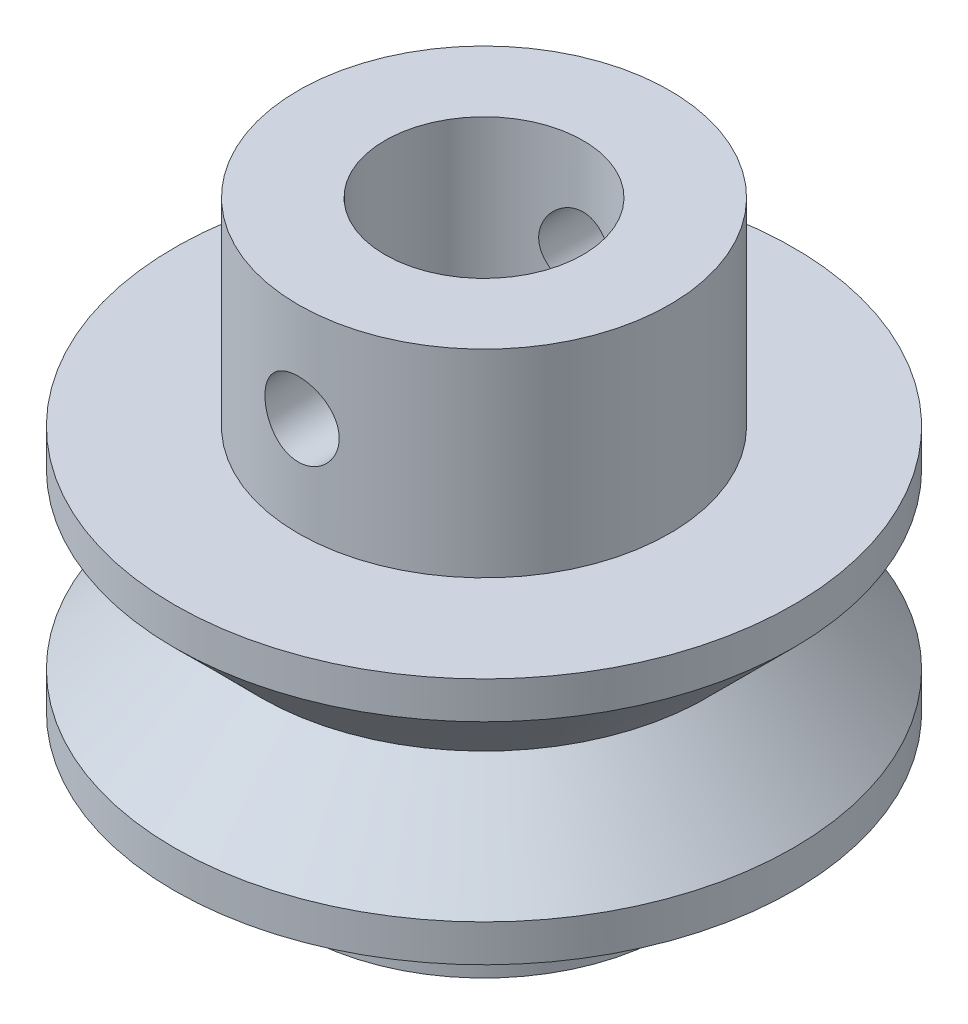
ISO-10303-21;
HEADER;
FILE_DESCRIPTION(('STEP AP214'),'2;1');
FILE_NAME('part.step','',(''),(''),'','','');
FILE_SCHEMA(('AUTOMOTIVE_DESIGN { 1 0 10303 214 1 1 1 1 }'));
ENDSEC;
DATA;
#1=APPLICATION_CONTEXT('core data for automotive mechanical design processes');
#2=APPLICATION_PROTOCOL_DEFINITION('international standard','automotive_design',2000,#1);
#3=PRODUCT_CONTEXT('',#1,'mechanical');
#4=PRODUCT('Part','Part','',(#3));
#5=PRODUCT_RELATED_PRODUCT_CATEGORY('part','',(#4));
#6=PRODUCT_DEFINITION_FORMATION('','',#4);
#7=PRODUCT_DEFINITION_CONTEXT('part definition',#1,'design');
#8=PRODUCT_DEFINITION('design','',#6,#7);
#9=PRODUCT_DEFINITION_SHAPE('','',#8);
#10=(LENGTH_UNIT() NAMED_UNIT(*) SI_UNIT(.MILLI.,.METRE.));
#11=(NAMED_UNIT(*) PLANE_ANGLE_UNIT() SI_UNIT($,.RADIAN.));
#12=(NAMED_UNIT(*) SI_UNIT($,.STERADIAN.) SOLID_ANGLE_UNIT());
#13=UNCERTAINTY_MEASURE_WITH_UNIT(LENGTH_MEASURE(1.E-05),#10,'distance_accuracy_value','');
#14=(GEOMETRIC_REPRESENTATION_CONTEXT(3) GLOBAL_UNCERTAINTY_ASSIGNED_CONTEXT((#13)) GLOBAL_UNIT_ASSIGNED_CONTEXT((#10,
#11,#12)) REPRESENTATION_CONTEXT('',''));
#15=CARTESIAN_POINT('',(0.,0.,0.));
#16=DIRECTION('',(0.,0.,1.));
#17=DIRECTION('',(1.,0.,0.));
#18=AXIS2_PLACEMENT_3D('',#15,#16,#17);
#19=CARTESIAN_POINT('',(0.,-5.,0.));
#20=DIRECTION('',(0.,1.,0.));
#21=DIRECTION('',(0.,0.,1.));
#22=AXIS2_PLACEMENT_3D('',#19,#20,#21);
#23=CYLINDRICAL_SURFACE('',#22,12.5);
#24=CARTESIAN_POINT('',(0.,3.5,0.));
#25=DIRECTION('',(0.,-1.,0.));
#26=DIRECTION('',(0.,0.,-1.));
#27=AXIS2_PLACEMENT_3D('',#24,#25,#26);
#28=CIRCLE('',#27,12.5);
#29=CARTESIAN_POINT('',(0.,3.5,-12.5));
#30=VERTEX_POINT('',#29);
#31=EDGE_CURVE('E102',#30,#30,#28,.T.);
#32=ORIENTED_EDGE('',*,*,#31,.F.);
#33=EDGE_LOOP('',(#32));
#34=FACE_BOUND('',#33,.T.);
#35=CARTESIAN_POINT('',(0.,5.,0.));
#36=DIRECTION('',(0.,1.,0.));
#37=DIRECTION('',(0.,0.,1.));
#38=AXIS2_PLACEMENT_3D('',#35,#36,#37);
#39=CIRCLE('',#38,12.5);
#40=CARTESIAN_POINT('',(0.,5.,12.5));
#41=VERTEX_POINT('',#40);
#42=EDGE_CURVE('E108',#41,#41,#39,.T.);
#43=ORIENTED_EDGE('',*,*,#42,.F.);
#44=EDGE_LOOP('',(#43));
#45=FACE_BOUND('',#44,.T.);
#46=ADVANCED_FACE('F43',(#34,#45),#23,.T.);
#47=CARTESIAN_POINT('',(0.,13.,0.));
#48=DIRECTION('',(0.,-1.,0.));
#49=DIRECTION('',(0.,0.,-1.));
#50=AXIS2_PLACEMENT_3D('',#47,#48,#49);
#51=CYLINDRICAL_SURFACE('',#50,7.5);
#52=CARTESIAN_POINT('',(0.,-9.,0.));
#53=DIRECTION('',(0.,1.,0.));
#54=DIRECTION('',(0.,0.,1.));
#55=AXIS2_PLACEMENT_3D('',#52,#53,#54);
#56=CIRCLE('',#55,7.5);
#57=CARTESIAN_POINT('',(0.,-9.,7.5));
#58=VERTEX_POINT('',#57);
#59=EDGE_CURVE('E117',#58,#58,#56,.T.);
#60=ORIENTED_EDGE('',*,*,#59,.T.);
#61=EDGE_LOOP('',(#60));
#62=FACE_BOUND('',#61,.T.);
#63=CARTESIAN_POINT('',(0.,-5.,0.));
#64=DIRECTION('',(0.,1.,0.));
#65=DIRECTION('',(0.,0.,1.));
#66=AXIS2_PLACEMENT_3D('',#63,#64,#65);
#67=CIRCLE('',#66,7.5);
#68=CARTESIAN_POINT('',(0.,-5.,7.5));
#69=VERTEX_POINT('',#68);
#70=EDGE_CURVE('E10',#69,#69,#67,.T.);
#71=ORIENTED_EDGE('',*,*,#70,.F.);
#72=EDGE_LOOP('',(#71));
#73=FACE_BOUND('',#72,.T.);
#74=ADVANCED_FACE('F132',(#62,#73),#51,.T.);
#75=CARTESIAN_POINT('',(0.,13.,0.));
#76=DIRECTION('',(0.,-1.,0.));
#77=DIRECTION('',(0.,0.,-1.));
#78=AXIS2_PLACEMENT_3D('',#75,#76,#77);
#79=CYLINDRICAL_SURFACE('',#78,4.);
#80=CARTESIAN_POINT('',(0.,10.5,-4.));
#81=CARTESIAN_POINT('',(-0.0812350589378528,10.5000029023031,-4.00000217456151));
#82=CARTESIAN_POINT('',(-0.162450241781792,10.4933802397516,-3.99750379283184));
#83=CARTESIAN_POINT('',(-0.322453452352361,10.4671718047301,-3.98778696006928));
#84=CARTESIAN_POINT('',(-0.401241827987615,10.4475878995294,-3.98056918893993));
#85=CARTESIAN_POINT('',(-0.554060784990879,10.3962469982282,-3.96218832391545));
#86=CARTESIAN_POINT('',(-0.628100224162279,10.3645134831782,-3.9510328434944));
#87=CARTESIAN_POINT('',(-0.769799310160254,10.2898935869842,-3.92588767765353));
#88=CARTESIAN_POINT('',(-0.837457239177879,10.2470042144558,-3.91189723227548));
#89=CARTESIAN_POINT('',(-0.967346417045825,10.1493874689291,-3.88186246971217));
#90=CARTESIAN_POINT('',(-1.02927073015119,10.0942697377406,-3.86576002583566));
#91=CARTESIAN_POINT('',(-1.14324421474363,9.97458956534116,-3.83360220871327));
#92=CARTESIAN_POINT('',(-1.19529036359203,9.91002424391213,-3.81754685135033));
#93=CARTESIAN_POINT('',(-1.28998202215985,9.77028253247679,-3.78662470617731));
#94=CARTESIAN_POINT('',(-1.3321939319576,9.69479563345418,-3.77182648820818));
#95=CARTESIAN_POINT('',(-1.40318646334084,9.53715164583148,-3.74599860237433));
#96=CARTESIAN_POINT('',(-1.43197244961239,9.4549972368449,-3.73496742975881));
#97=CARTESIAN_POINT('',(-1.47408431017549,9.2898832597418,-3.71854412824136));
#98=CARTESIAN_POINT('',(-1.48799593218558,9.20709496156456,-3.71293924350838));
#99=CARTESIAN_POINT('',(-1.50179556531648,9.04018384200616,-3.70738061461215));
#100=CARTESIAN_POINT('',(-1.5016893680263,8.95606158612553,-3.70742453659305));
#101=CARTESIAN_POINT('',(-1.48790429610018,8.79423047478704,-3.71297511632055));
#102=CARTESIAN_POINT('',(-1.47503808509003,8.71643909395583,-3.71815468871122));
#103=CARTESIAN_POINT('',(-1.4374416786833,8.56421284959468,-3.73284938059529));
#104=CARTESIAN_POINT('',(-1.41270969663258,8.48977849338612,-3.74236515298863));
#105=CARTESIAN_POINT('',(-1.35163748571904,8.34472293227177,-3.76485702190253));
#106=CARTESIAN_POINT('',(-1.31508648737101,8.2742005138787,-3.77789517988166));
#107=CARTESIAN_POINT('',(-1.23156073762698,8.14005426240903,-3.80594210139319));
#108=CARTESIAN_POINT('',(-1.18458238728897,8.0764328224803,-3.82095154457158));
#109=CARTESIAN_POINT('',(-1.07781780766549,7.95339633634913,-3.85248038859113));
#110=CARTESIAN_POINT('',(-1.01738298716956,7.89455135925191,-3.86903347455671));
#111=CARTESIAN_POINT('',(-0.887312590819021,7.7876620337942,-3.90091728164085));
#112=CARTESIAN_POINT('',(-0.817675603497364,7.73961934539433,-3.91624781465952));
#113=CARTESIAN_POINT('',(-0.66972343699242,7.65506960293748,-3.9442639480908));
#114=CARTESIAN_POINT('',(-0.59129071384472,7.61875241877894,-3.95690498259616));
#115=CARTESIAN_POINT('',(-0.428836850524584,7.56001739572996,-3.97778718326962));
#116=CARTESIAN_POINT('',(-0.344818210845768,7.53759338343888,-3.98603030341493));
#117=CARTESIAN_POINT('',(-0.178375243148666,7.50837721245806,-3.99684443228065));
#118=CARTESIAN_POINT('',(-0.0961036195622104,7.50081739361749,-3.99969369025686));
#119=CARTESIAN_POINT('',(0.0685724752550233,7.49930893610008,-4.00025893700126));
#120=CARTESIAN_POINT('',(0.150976912983372,7.50535727968322,-3.99797606386863));
#121=CARTESIAN_POINT('',(0.310262048561858,7.53031004230867,-3.98871709772643));
#122=CARTESIAN_POINT('',(0.387233328007335,7.54871154373709,-3.98192470962305));
#123=CARTESIAN_POINT('',(0.53694175495722,7.59718607254732,-3.96451477091717));
#124=CARTESIAN_POINT('',(0.609678350347534,7.62726061794804,-3.9538967228203));
#125=CARTESIAN_POINT('',(0.751247765110155,7.69918641243948,-3.92949624407681));
#126=CARTESIAN_POINT('',(0.819903083557794,7.74135772922339,-3.91563000209348));
#127=CARTESIAN_POINT('',(0.949392711726624,7.83591810317156,-3.88626671564664));
#128=CARTESIAN_POINT('',(1.01022412027045,7.88831093254515,-3.87076907009516));
#129=CARTESIAN_POINT('',(1.12603079874454,8.00540412212428,-3.8387332949099));
#130=CARTESIAN_POINT('',(1.18046154123568,8.0706421827727,-3.82218696503729));
#131=CARTESIAN_POINT('',(1.27771050031903,8.20965138470766,-3.79078815746854));
#132=CARTESIAN_POINT('',(1.32052767414518,8.2834232913885,-3.77593583194399));
#133=CARTESIAN_POINT('',(1.39337773518998,8.43801598677231,-3.74966829822463));
#134=CARTESIAN_POINT('',(1.42335685446918,8.51886474591043,-3.73826760328493));
#135=CARTESIAN_POINT('',(1.46907883466889,8.68500976368782,-3.72054032891005));
#136=CARTESIAN_POINT('',(1.48483050305535,8.77030323619812,-3.71421061057491));
#137=CARTESIAN_POINT('',(1.50086347097839,8.93701615954112,-3.70775894792573));
#138=CARTESIAN_POINT('',(1.50207331495837,9.01833263171689,-3.70726444523341));
#139=CARTESIAN_POINT('',(1.49136715641593,9.17994531627617,-3.71158412745292));
#140=CARTESIAN_POINT('',(1.47945239850124,9.26024162467158,-3.71639780898899));
#141=CARTESIAN_POINT('',(1.44355815630242,9.41504722671655,-3.73048141585432));
#142=CARTESIAN_POINT('',(1.41995798316524,9.48965834624535,-3.73961085376663));
#143=CARTESIAN_POINT('',(1.3616969677992,9.63390550849442,-3.76121548297845));
#144=CARTESIAN_POINT('',(1.32703332944945,9.70354028807014,-3.77369151995215));
#145=CARTESIAN_POINT('',(1.24552075938154,9.83982678969763,-3.80139723903964));
#146=CARTESIAN_POINT('',(1.1981283280301,9.90613079679991,-3.81673698440964));
#147=CARTESIAN_POINT('',(1.09334485729906,10.0301415609712,-3.84806246757177));
#148=CARTESIAN_POINT('',(1.03595064012808,10.0878455747868,-3.86404840943145));
#149=CARTESIAN_POINT('',(0.909080396784624,10.1962019558218,-3.89590424609881));
#150=CARTESIAN_POINT('',(0.839118644212993,10.2463037534347,-3.91172104900645));
#151=CARTESIAN_POINT('',(0.691213223200822,10.3340226552766,-3.94054514457031));
#152=CARTESIAN_POINT('',(0.613268934090622,10.3716387877364,-3.95355221851559));
#153=CARTESIAN_POINT('',(0.447999082002313,10.4343768290483,-3.9757429260668));
#154=CARTESIAN_POINT('',(0.360413422234209,10.4588870646019,-3.98473657158356));
#155=CARTESIAN_POINT('',(0.181875733606382,10.4916929599207,-3.99686242179587));
#156=CARTESIAN_POINT('',(0.090925416364859,10.4999967514873,-3.99999756603967));
#157=CARTESIAN_POINT('',(0.,10.5,-4.));
#158=B_SPLINE_CURVE_WITH_KNOTS('',3,(#80,#81,#82,#83,#84,#85,#86,#87,#88,#89,#90,#91,#92,#93,
#94,#95,#96,#97,#98,#99,#100,#101,#102,#103,#104,#105,#106,#107,#108,#109,#110,#111,#112,#113,
#114,#115,#116,#117,#118,#119,#120,#121,#122,#123,#124,#125,#126,#127,#128,#129,#130,#131,#132,
#133,#134,#135,#136,#137,#138,#139,#140,#141,#142,#143,#144,#145,#146,#147,#148,#149,#150,#151,
#152,#153,#154,#155,#156,#157),.UNSPECIFIED.,.T.,.F.,(4,2,2,2,2,2,2,2,2,2,2,2,2,2,2,2,2,2,2,2,2,
2,2,2,2,2,2,2,2,2,2,2,2,2,2,2,2,2,4),(0.,0.243369801560559,0.48670454953046,0.729571369213574,
0.972503379609489,1.22473618582715,1.47704604925622,1.73896674501659,2.00078269352134,
2.25185874416901,2.50283106079707,2.73878345119971,2.97477138060589,3.21522408387018,
3.45575990744258,3.71246153335813,3.96920257905066,4.22991375286075,4.49050899698846,
4.73725019635925,4.9839366839052,5.2211443792384,5.45838293254453,5.70259221859599,
5.94689180019868,6.20536519455658,6.46386178920141,6.72343066727204,6.98283874956507,
7.22558763480252,7.46831350211259,7.70363142426534,7.93900886656506,8.18672471884271,
8.43451941997062,8.69572329654039,8.95694749805102,9.22948515032042,9.50188601796127),.UNSPECIFIED.);
#159=CARTESIAN_POINT('',(0.,10.5,-4.));
#160=VERTEX_POINT('',#159);
#161=EDGE_CURVE('E90',#160,#160,#158,.T.);
#162=ORIENTED_EDGE('',*,*,#161,.F.);
#163=EDGE_LOOP('',(#162));
#164=FACE_BOUND('',#163,.T.);
#165=CARTESIAN_POINT('',(1.5,9.,3.70809924354784));
#166=CARTESIAN_POINT('',(1.50000304106109,8.91899251627921,3.70809640633806));
#167=CARTESIAN_POINT('',(1.49341597549487,8.83800507749637,3.71078260240986));
#168=CARTESIAN_POINT('',(1.46736187895468,8.6784719170868,3.72116159304967));
#169=CARTESIAN_POINT('',(1.44789523373263,8.59992612240499,3.72885423767112));
#170=CARTESIAN_POINT('',(1.39689657610574,8.44762462838648,3.748254802809));
#171=CARTESIAN_POINT('',(1.36539347266348,8.37385794334892,3.7599530956926));
#172=CARTESIAN_POINT('',(1.29131856742698,8.23262810318116,3.78603134206598));
#173=CARTESIAN_POINT('',(1.24874344095039,8.16516684971748,3.80041210067323));
#174=CARTESIAN_POINT('',(1.15146661374162,8.03510968837718,3.83103574665713));
#175=CARTESIAN_POINT('',(1.09630381213306,7.97287147037061,3.84733341923603));
#176=CARTESIAN_POINT('',(0.976395839778926,7.85827718532851,3.87949750628547));
#177=CARTESIAN_POINT('',(0.911648630256679,7.80592322625815,3.89536382814785));
#178=CARTESIAN_POINT('',(0.7716946551776,7.71086048770439,3.92552873936553));
#179=CARTESIAN_POINT('',(0.696206947538027,7.66854052528414,3.93975561223505));
#180=CARTESIAN_POINT('',(0.538555771965247,7.59734882747509,3.96438007973848));
#181=CARTESIAN_POINT('',(0.456394630933536,7.56847242800803,3.97477900217006));
#182=CARTESIAN_POINT('',(0.291489341676832,7.52624210422539,3.9901869710344));
#183=CARTESIAN_POINT('',(0.208923197281596,7.51227237255954,3.99540915214774));
#184=CARTESIAN_POINT('',(0.042464363794786,7.49827879905501,4.0006401410794));
#185=CARTESIAN_POINT('',(-0.041427885062833,7.49825042238129,4.00065064414902));
#186=CARTESIAN_POINT('',(-0.203743543064476,7.51178176146517,3.99559265903894));
#187=CARTESIAN_POINT('',(-0.2822321782669,7.52466929794882,3.99077541996683));
#188=CARTESIAN_POINT('',(-0.435839217984391,7.56253591522555,3.97693274932263));
#189=CARTESIAN_POINT('',(-0.510957383430298,7.58751585226204,3.96790701975578));
#190=CARTESIAN_POINT('',(-0.656989017303104,7.64917045167585,3.94637769167531));
#191=CARTESIAN_POINT('',(-0.727825392287309,7.68601000526841,3.93382539470077));
#192=CARTESIAN_POINT('',(-0.862486607957559,7.77019209692939,3.90651310225279));
#193=CARTESIAN_POINT('',(-0.926309176932323,7.8175380230176,3.8917523951284));
#194=CARTESIAN_POINT('',(-1.04909048680094,7.92462728628319,3.86052529655816));
#195=CARTESIAN_POINT('',(-1.10754614526348,7.98493391565043,3.84400963763883));
#196=CARTESIAN_POINT('',(-1.21370395569342,8.11459299332156,3.81182460645722));
#197=CARTESIAN_POINT('',(-1.261403406929,8.18394770658664,3.79615544748847));
#198=CARTESIAN_POINT('',(-1.34565611808151,8.33171946746282,3.76712703500335));
#199=CARTESIAN_POINT('',(-1.38193847851831,8.41030349368607,3.75382677150277));
#200=CARTESIAN_POINT('',(-1.44056464441501,8.57309622516757,3.73172438629002));
#201=CARTESIAN_POINT('',(-1.46291620605595,8.65730177159369,3.72291976205783));
#202=CARTESIAN_POINT('',(-1.49190191709668,8.82397596231595,3.71139597222848));
#203=CARTESIAN_POINT('',(-1.49933521158966,8.90628410553614,3.70836785241537));
#204=CARTESIAN_POINT('',(-1.50057885636272,9.07100935674174,3.70786539525016));
#205=CARTESIAN_POINT('',(-1.49439261093762,9.15342643235247,3.71038967003987));
#206=CARTESIAN_POINT('',(-1.46929733520157,9.31192992228768,3.72039381629735));
#207=CARTESIAN_POINT('',(-1.45100618334225,9.38813113576466,3.72763276216449));
#208=CARTESIAN_POINT('',(-1.40299774640637,9.53634794472019,3.74596487046362));
#209=CARTESIAN_POINT('',(-1.37327812034623,9.60836267916813,3.75705882250173));
#210=CARTESIAN_POINT('',(-1.30200292275278,9.74916443807621,3.7823624311608));
#211=CARTESIAN_POINT('',(-1.26004545177047,9.81772929213734,3.79667328892065));
#212=CARTESIAN_POINT('',(-1.16591317862479,9.94712898172604,3.82662814294291));
#213=CARTESIAN_POINT('',(-1.11373463696435,10.0079609746246,3.84227262594077));
#214=CARTESIAN_POINT('',(-0.996727340900938,10.1241683731951,3.87433046553184));
#215=CARTESIAN_POINT('',(-0.931306341491061,10.1789534087688,3.89072969357028));
#216=CARTESIAN_POINT('',(-0.79179747175315,10.2768383675894,3.92149874963302));
#217=CARTESIAN_POINT('',(-0.717709573322673,10.3199382529458,3.93586857107664));
#218=CARTESIAN_POINT('',(-0.563016329468477,10.3929460561996,3.96094985704552));
#219=CARTESIAN_POINT('',(-0.482434433064626,10.4228991237926,3.9716738133801));
#220=CARTESIAN_POINT('',(-0.316881887523254,10.4686564138499,3.98829436712571));
#221=CARTESIAN_POINT('',(-0.231913320723593,10.4844672854224,3.99419323299412));
#222=CARTESIAN_POINT('',(-0.0653355852738154,10.5007744027548,4.00028407317073));
#223=CARTESIAN_POINT('',(0.0161807680608454,10.502109483059,4.00078860953764));
#224=CARTESIAN_POINT('',(0.178226786412424,10.4915848405546,3.99684889809223));
#225=CARTESIAN_POINT('',(0.258756569245257,10.4797267091141,3.9924052471313));
#226=CARTESIAN_POINT('',(0.414548248377126,10.4437411485064,3.97921089603771));
#227=CARTESIAN_POINT('',(0.489890731068835,10.4199200941216,3.97056791378017));
#228=CARTESIAN_POINT('',(0.63551547300639,10.3609899866156,3.9498778362099));
#229=CARTESIAN_POINT('',(0.705796771275543,10.3258787966952,3.93783009655664));
#230=CARTESIAN_POINT('',(0.842540176994413,10.2436860564952,3.91090618300074));
#231=CARTESIAN_POINT('',(0.90871754884685,10.1961633594859,3.89593240108828));
#232=CARTESIAN_POINT('',(1.03241734752336,10.0911921698124,3.86499507694844));
#233=CARTESIAN_POINT('',(1.0899366712559,10.0337401341921,3.84903118274027));
#234=CARTESIAN_POINT('',(1.19781214236196,9.90693586835494,3.81688129739175));
#235=CARTESIAN_POINT('',(1.24762999816025,9.83711559784569,3.8007280534916));
#236=CARTESIAN_POINT('',(1.33484709556843,9.68958413042668,3.77098325003638));
#237=CARTESIAN_POINT('',(1.37224504878157,9.61187211594652,3.75739195631217));
#238=CARTESIAN_POINT('',(1.4346588697426,9.4470443190246,3.73402269853266));
#239=CARTESIAN_POINT('',(1.45906002899523,9.35966563348822,3.7244380329086));
#240=CARTESIAN_POINT('',(1.49172356722079,9.18151472804422,3.71147994336315));
#241=CARTESIAN_POINT('',(1.49999659339571,9.09074478729001,3.70810242179737));
#242=CARTESIAN_POINT('',(1.5,9.,3.70809924354784));
#243=B_SPLINE_CURVE_WITH_KNOTS('',3,(#165,#166,#167,#168,#169,#170,#171,#172,#173,#174,#175,
#176,#177,#178,#179,#180,#181,#182,#183,#184,#185,#186,#187,#188,#189,#190,#191,#192,#193,#194,
#195,#196,#197,#198,#199,#200,#201,#202,#203,#204,#205,#206,#207,#208,#209,#210,#211,#212,#213,
#214,#215,#216,#217,#218,#219,#220,#221,#222,#223,#224,#225,#226,#227,#228,#229,#230,#231,#232,
#233,#234,#235,#236,#237,#238,#239,#240,#241,#242),.UNSPECIFIED.,.T.,.F.,(4,2,2,2,2,2,2,2,2,2,2,
2,2,2,2,2,2,2,2,2,2,2,2,2,2,2,2,2,2,2,2,2,2,2,2,2,2,2,4),(0.,0.242684541416169,
0.485361814598854,0.727459856757029,0.969630679682932,1.22274652401128,1.47591628822983,
1.73770072136421,1.9993942638133,2.24980018489679,2.50012465404857,2.73806472803194,
2.97602165263335,3.21744131210668,3.45893893628976,3.71456675065874,3.97025867827334,
4.23162592252966,4.49284751635474,4.73965657740485,4.98640395388884,5.22143845928199,
5.45652113429526,5.70041561005821,5.94439948466355,6.20385016993624,6.46330169650178,
6.72185508890168,6.98028685560127,7.22365720549936,7.4669982031948,7.70440274003891,
7.94185223512831,8.18928323676987,8.43680270894965,8.69738599542079,8.95799630544242,
9.23003178870926,9.50188762323053),.UNSPECIFIED.);
#244=CARTESIAN_POINT('',(1.5,9.,3.70809924354784));
#245=VERTEX_POINT('',#244);
#246=EDGE_CURVE('E85',#245,#245,#243,.T.);
#247=ORIENTED_EDGE('',*,*,#246,.F.);
#248=EDGE_LOOP('',(#247));
#249=FACE_BOUND('',#248,.T.);
#250=CARTESIAN_POINT('',(0.,13.,0.));
#251=DIRECTION('',(0.,1.,0.));
#252=DIRECTION('',(0.,0.,1.));
#253=AXIS2_PLACEMENT_3D('',#250,#251,#252);
#254=CIRCLE('',#253,4.);
#255=CARTESIAN_POINT('',(0.,13.,4.));
#256=VERTEX_POINT('',#255);
#257=EDGE_CURVE('E61',#256,#256,#254,.T.);
#258=ORIENTED_EDGE('',*,*,#257,.T.);
#259=EDGE_LOOP('',(#258));
#260=FACE_BOUND('',#259,.T.);
#261=CARTESIAN_POINT('',(0.,-9.,0.));
#262=DIRECTION('',(0.,1.,0.));
#263=DIRECTION('',(0.,0.,1.));
#264=AXIS2_PLACEMENT_3D('',#261,#262,#263);
#265=CIRCLE('',#264,4.);
#266=CARTESIAN_POINT('',(0.,-9.,4.));
#267=VERTEX_POINT('',#266);
#268=EDGE_CURVE('E114',#267,#267,#265,.T.);
#269=ORIENTED_EDGE('',*,*,#268,.F.);
#270=EDGE_LOOP('',(#269));
#271=FACE_BOUND('',#270,.T.);
#272=ADVANCED_FACE('F45',(#164,#249,#260,#271),#79,.F.);
#273=CARTESIAN_POINT('',(0.,10.5,-7.5));
#274=CARTESIAN_POINT('',(-0.0833653601889497,10.4999969332525,-7.49999846371307));
#275=CARTESIAN_POINT('',(-0.166769490302283,10.4930267355485,-7.49859577767346));
#276=CARTESIAN_POINT('',(-0.331220261533529,10.4653522498271,-7.49313548434847));
#277=CARTESIAN_POINT('',(-0.412264976312033,10.4446370507977,-7.48907576790279));
#278=CARTESIAN_POINT('',(-0.569595457894969,10.3901380895688,-7.4787547391743));
#279=CARTESIAN_POINT('',(-0.645885701899701,10.356366844733,-7.47249553615077));
#280=CARTESIAN_POINT('',(-0.791711983296338,10.2767516287331,-7.45845597052971));
#281=CARTESIAN_POINT('',(-0.861248422613717,10.2309083765892,-7.4506756985356));
#282=CARTESIAN_POINT('',(-0.992540215972297,10.1277922585629,-7.43433247994955));
#283=CARTESIAN_POINT('',(-1.05419092673779,10.0703874669132,-7.42576118256521));
#284=CARTESIAN_POINT('',(-1.16705513491204,9.94606137541245,-7.40886270678882));
#285=CARTESIAN_POINT('',(-1.21826781715564,9.87913933299732,-7.40053554750636));
#286=CARTESIAN_POINT('',(-1.30924763002143,9.73692571048219,-7.38498662718923));
#287=CARTESIAN_POINT('',(-1.3489064082988,9.66156353430546,-7.37777561047419));
#288=CARTESIAN_POINT('',(-1.41495849987046,9.50507727149388,-7.36539402087627));
#289=CARTESIAN_POINT('',(-1.44135312365586,9.42395375498048,-7.36022324642942));
#290=CARTESIAN_POINT('',(-1.47978794982724,9.25937345413812,-7.35259207878307));
#291=CARTESIAN_POINT('',(-1.49201174693817,9.17596118378666,-7.35009705160781));
#292=CARTESIAN_POINT('',(-1.50232819158918,9.00823526795349,-7.34799562590941));
#293=CARTESIAN_POINT('',(-1.50042228407025,8.92392171551978,-7.34838893201761));
#294=CARTESIAN_POINT('',(-1.48268185965273,8.7581298179685,-7.35198826722277));
#295=CARTESIAN_POINT('',(-1.46705781036586,8.67662789155903,-7.35515179288145));
#296=CARTESIAN_POINT('',(-1.42265682693458,8.5174258850055,-7.36386819240002));
#297=CARTESIAN_POINT('',(-1.39387926465102,8.43972598662149,-7.36942118036668));
#298=CARTESIAN_POINT('',(-1.32378717551208,8.2897271074446,-7.38233427750612));
#299=CARTESIAN_POINT('',(-1.28238922684817,8.21746818064624,-7.38970634720557));
#300=CARTESIAN_POINT('',(-1.18829036185902,8.08084372504078,-7.40541928159593));
#301=CARTESIAN_POINT('',(-1.13558814653524,8.01647910472327,-7.41376025757549));
#302=CARTESIAN_POINT('',(-1.01924990184088,7.8962558963146,-7.43065531862193));
#303=CARTESIAN_POINT('',(-0.955434241818667,7.84057114821131,-7.43921053816357));
#304=CARTESIAN_POINT('',(-0.819277536093015,7.74066923054817,-7.45543273071613));
#305=CARTESIAN_POINT('',(-0.746936381069084,7.69645220805963,-7.4630996923346));
#306=CARTESIAN_POINT('',(-0.595589080318381,7.62070873616104,-7.47670035241331));
#307=CARTESIAN_POINT('',(-0.51657272937795,7.5892021595332,-7.48263133272408));
#308=CARTESIAN_POINT('',(-0.354223464672998,7.53995928894215,-7.49207113481787));
#309=CARTESIAN_POINT('',(-0.270891075108675,7.52222132688956,-7.49558025000797));
#310=CARTESIAN_POINT('',(-0.103769108440727,7.50126531930858,-7.49974007800302));
#311=CARTESIAN_POINT('',(-0.0200104924883652,7.4978093706896,-7.50043761978705));
#312=CARTESIAN_POINT('',(0.14688740128907,7.50487478841327,-7.49902577895154));
#313=CARTESIAN_POINT('',(0.230026713665689,7.51539536902889,-7.49691655412169));
#314=CARTESIAN_POINT('',(0.392558489919811,7.54991756031594,-7.49015748012026));
#315=CARTESIAN_POINT('',(0.471977922509854,7.57379710274686,-7.4855306460631));
#316=CARTESIAN_POINT('',(0.6256854412495,7.63422597398371,-7.47425328091549));
#317=CARTESIAN_POINT('',(0.699973142456309,7.67077625201525,-7.4676025982134));
#318=CARTESIAN_POINT('',(0.842311760529326,7.75602373597697,-7.45289867299942));
#319=CARTESIAN_POINT('',(0.910275190128281,7.80486417155842,-7.44482925655578));
#320=CARTESIAN_POINT('',(1.03712702867881,7.91311378681092,-7.42822102244824));
#321=CARTESIAN_POINT('',(1.09601446339614,7.9725240995998,-7.41968215452582));
#322=CARTESIAN_POINT('',(1.20396088616126,8.10131002783669,-7.40293955335447));
#323=CARTESIAN_POINT('',(1.25285655367298,8.17082361633201,-7.39474290349956));
#324=CARTESIAN_POINT('',(1.33827813007681,8.31721704203502,-7.37976287694291));
#325=CARTESIAN_POINT('',(1.37480453388435,8.39409658436033,-7.37297944370014));
#326=CARTESIAN_POINT('',(1.43422776237294,8.55265236922432,-7.36165110876574));
#327=CARTESIAN_POINT('',(1.45719524968658,8.63430126181548,-7.3570946230828));
#328=CARTESIAN_POINT('',(1.48906297744079,8.80040018023636,-7.35071155188038));
#329=CARTESIAN_POINT('',(1.49796505233767,8.88484983931402,-7.34888461036667));
#330=CARTESIAN_POINT('',(1.5013813663012,9.05251329681648,-7.34818724447069));
#331=CARTESIAN_POINT('',(1.49615368210634,9.13572172339052,-7.34926378783951));
#332=CARTESIAN_POINT('',(1.47202845615009,9.30004747485754,-7.35413360226921));
#333=CARTESIAN_POINT('',(1.45313102419395,9.38116481654221,-7.35792685150754));
#334=CARTESIAN_POINT('',(1.40231785274843,9.53884156686082,-7.36777896328738));
#335=CARTESIAN_POINT('',(1.37043376007602,9.61541154075362,-7.37383231528246));
#336=CARTESIAN_POINT('',(1.29458196690241,9.76215558110166,-7.38752572461255));
#337=CARTESIAN_POINT('',(1.25061325316232,9.83232911058771,-7.39516591498341));
#338=CARTESIAN_POINT('',(1.15095887217962,9.96557335822547,-7.41133440784838));
#339=CARTESIAN_POINT('',(1.09508683085277,10.0285031479014,-7.41987559364549));
#340=CARTESIAN_POINT('',(0.973596553519712,10.1441793082938,-7.43679122807932));
#341=CARTESIAN_POINT('',(0.907976080730003,10.1969233354759,-7.44516563794777));
#342=CARTESIAN_POINT('',(0.768026443632371,10.2912519659197,-7.46090748581957));
#343=CARTESIAN_POINT('',(0.693613326644753,10.33271400492,-7.46826346828869));
#344=CARTESIAN_POINT('',(0.5387495414111,10.4024791838949,-7.481026876275));
#345=CARTESIAN_POINT('',(0.45830439129469,10.4307941842987,-7.48643605707924));
#346=CARTESIAN_POINT('',(0.314732233385671,10.4679779220671,-7.49364558893056));
#347=CARTESIAN_POINT('',(0.252422496020678,10.4799647905616,-7.49601454737678));
#348=CARTESIAN_POINT('',(0.126749287815102,10.4959768685375,-7.49919231209839));
#349=CARTESIAN_POINT('',(0.0633858506229291,10.5000023317647,-7.50000116809732));
#350=CARTESIAN_POINT('',(0.,10.5,-7.5));
#351=B_SPLINE_CURVE_WITH_KNOTS('',3,(#273,#274,#275,#276,#277,#278,#279,#280,#281,#282,#283,
#284,#285,#286,#287,#288,#289,#290,#291,#292,#293,#294,#295,#296,#297,#298,#299,#300,#301,#302,
#303,#304,#305,#306,#307,#308,#309,#310,#311,#312,#313,#314,#315,#316,#317,#318,#319,#320,#321,
#322,#323,#324,#325,#326,#327,#328,#329,#330,#331,#332,#333,#334,#335,#336,#337,#338,#339,#340,
#341,#342,#343,#344,#345,#346,#347,#348,#349,#350),.UNSPECIFIED.,.T.,.F.,(4,2,2,2,2,2,2,2,2,2,2,
2,2,2,2,2,2,2,2,2,2,2,2,2,2,2,2,2,2,2,2,2,2,2,2,2,2,2,4),(0.,0.249864195991888,
0.499926976036984,0.749750602875512,0.999559353346295,1.25239900516828,1.50525839512105,
1.76041792508884,2.01555224047796,2.26734277655381,2.51910756421838,2.76707590509417,
3.01505608880594,3.26471235305389,3.51439732124506,3.76857378737026,4.0227535130973,
4.27732912281036,4.53187388547054,4.78216103514398,5.03243411486801,5.28045680926085,
5.52849808824033,5.77957599050038,6.03068082518895,6.28560942868839,6.540527830852,
6.79410571549084,7.04765052495622,7.29659583851552,7.54553915238912,7.79387941879665,
8.042240513728,8.29482114358714,8.54745981799395,8.80274245013455,9.05779433276278,
9.2477816293484,9.43776287056494),.UNSPECIFIED.);
#352=CARTESIAN_POINT('',(0.,10.5,-7.5));
#353=VERTEX_POINT('',#352);
#354=EDGE_CURVE('E48',#353,#353,#351,.T.);
#355=ORIENTED_EDGE('',*,*,#354,.T.);
#356=EDGE_LOOP('',(#355));
#357=FACE_BOUND('',#356,.T.);
#358=CARTESIAN_POINT('',(1.5,9.,7.34846922834954));
#359=CARTESIAN_POINT('',(1.49999691881235,8.91665343676424,7.3484708853835));
#360=CARTESIAN_POINT('',(1.49302975757707,8.83326806500025,7.34990262402619));
#361=CARTESIAN_POINT('',(1.46536842537441,8.66885624228504,7.35546646957746));
#362=CARTESIAN_POINT('',(1.44466327060578,8.58783173304596,7.35960073717297));
#363=CARTESIAN_POINT('',(1.39019367392958,8.43054404496875,7.37008310582666));
#364=CARTESIAN_POINT('',(1.35644222122892,8.35427621770113,7.37642900431582));
#365=CARTESIAN_POINT('',(1.27687366150577,8.20848773295455,7.39061699221019));
#366=CARTESIAN_POINT('',(1.23105722790173,8.13896669919314,7.398458998102));
#367=CARTESIAN_POINT('',(1.12796861348015,8.00765849421921,7.4148794954137));
#368=CARTESIAN_POINT('',(1.07055848386998,7.94598061817404,7.42346606755867));
#369=CARTESIAN_POINT('',(0.946210183531966,7.83306369963153,7.440337084539));
#370=CARTESIAN_POINT('',(0.879271345466976,7.78182538887421,7.44862150816248));
#371=CARTESIAN_POINT('',(0.737042033886383,7.69081797355731,7.46404194626342));
#372=CARTESIAN_POINT('',(0.661683851508315,7.65115272927504,7.47116732162326));
#373=CARTESIAN_POINT('',(0.505206225580907,7.5850875944278,7.48337605325447));
#374=CARTESIAN_POINT('',(0.424087322130829,7.55868646214852,7.48845960066179));
#375=CARTESIAN_POINT('',(0.259525159917741,7.52023920957056,7.49595481032628));
#376=CARTESIAN_POINT('',(0.176126608822221,7.50800853364349,7.4984007943219));
#377=CARTESIAN_POINT('',(0.00842785265630407,7.49767357224253,7.50046381775405));
#378=CARTESIAN_POINT('',(-0.075872264747765,7.49956792553127,7.50008112979138));
#379=CARTESIAN_POINT('',(-0.241713001115383,7.51728927032333,7.49655652302773));
#380=CARTESIAN_POINT('',(-0.323275821447705,7.53291746575177,7.49345397548757));
#381=CARTESIAN_POINT('',(-0.482597439870451,7.57734754868834,7.48488265739113));
#382=CARTESIAN_POINT('',(-0.560356085620694,7.60614996328781,7.47941379216059));
#383=CARTESIAN_POINT('',(-0.710429194801331,7.6762950602209,7.46665944029938));
#384=CARTESIAN_POINT('',(-0.78270626120085,7.71771562665733,7.45936272262835));
#385=CARTESIAN_POINT('',(-0.919357568789633,7.8118636158549,7.44375704210678));
#386=CARTESIAN_POINT('',(-0.983730899287501,7.86459233965577,7.43544796282833));
#387=CARTESIAN_POINT('',(-1.10392714658019,7.98095043316271,7.41856446546689));
#388=CARTESIAN_POINT('',(-1.15958147486045,8.04475378009439,7.40998794686274));
#389=CARTESIAN_POINT('',(-1.25942773976521,8.18087466367613,7.39367357398141));
#390=CARTESIAN_POINT('',(-1.30361945959163,8.25319236132479,7.38593573556822));
#391=CARTESIAN_POINT('',(-1.37934422220282,8.40453124773271,7.37217071209385));
#392=CARTESIAN_POINT('',(-1.41084997166656,8.4835664514595,7.36614722345324));
#393=CARTESIAN_POINT('',(-1.46008551244137,8.64595698558599,7.35654714481909));
#394=CARTESIAN_POINT('',(-1.47781709918496,8.72931175142863,7.35297023592642));
#395=CARTESIAN_POINT('',(-1.49874900905408,8.89644728699857,7.34873218901742));
#396=CARTESIAN_POINT('',(-1.50219278834687,8.98019636146551,7.34802220585731));
#397=CARTESIAN_POINT('',(-1.49510644246611,9.14707233479953,7.34946728533281));
#398=CARTESIAN_POINT('',(-1.48457710968366,9.23019926867829,7.35162218550582));
#399=CARTESIAN_POINT('',(-1.45005331211124,9.39265296043835,7.35850848742372));
#400=CARTESIAN_POINT('',(-1.42618893125895,9.47200851455364,7.36321498521745));
#401=CARTESIAN_POINT('',(-1.36581155296278,9.62559491854311,7.37465234027497));
#402=CARTESIAN_POINT('',(-1.32929751355976,9.69982534565358,7.38138336429404));
#403=CARTESIAN_POINT('',(-1.2441062133234,9.84211966492524,7.39622108943059));
#404=CARTESIAN_POINT('',(-1.19527661697413,9.91009056945124,7.40434457797355));
#405=CARTESIAN_POINT('',(-1.08704335831907,10.0369624680014,7.42100585739955));
#406=CARTESIAN_POINT('',(-1.02763860771681,10.0958625273739,7.42954369085727));
#407=CARTESIAN_POINT('',(-0.898848410246836,10.2038438387784,7.44623018803823));
#408=CARTESIAN_POINT('',(-0.829323748394445,10.252760481975,7.45437086563026));
#409=CARTESIAN_POINT('',(-0.682901844952133,10.3382188222494,7.4692069144293));
#410=CARTESIAN_POINT('',(-0.606004913150261,10.3747610390172,7.47590234632816));
#411=CARTESIAN_POINT('',(-0.447454021236019,10.43419330762,7.487059410916));
#412=CARTESIAN_POINT('',(-0.365830010217116,10.4571607773394,7.49153368713906));
#413=CARTESIAN_POINT('',(-0.199784182019868,10.4890368714958,7.4977985390649));
#414=CARTESIAN_POINT('',(-0.115362703066821,10.4979471892135,7.49958943799765));
#415=CARTESIAN_POINT('',(0.0523093408554351,10.5013904714443,7.50027810681181));
#416=CARTESIAN_POINT('',(0.135554718212254,10.4961709206843,7.49922567824026));
#417=CARTESIAN_POINT('',(0.299956546973462,10.4720490741783,7.49445065340477));
#418=CARTESIAN_POINT('',(0.381113024630537,10.4531469504779,7.49072809071528));
#419=CARTESIAN_POINT('',(0.538879124617644,10.4023065118625,7.481032475475));
#420=CARTESIAN_POINT('',(0.615498664860421,10.3703979328032,7.47506455871866));
#421=CARTESIAN_POINT('',(0.762331830278929,10.2944816380037,7.46152083185077));
#422=CARTESIAN_POINT('',(0.832544948651117,10.2504729661444,7.45394489468828));
#423=CARTESIAN_POINT('',(0.965795835159536,10.1507709194069,7.43786398736791));
#424=CARTESIAN_POINT('',(1.02869957417475,10.0949004954198,7.4293460013317));
#425=CARTESIAN_POINT('',(1.14432392663527,9.97342463985635,7.41241834355477));
#426=CARTESIAN_POINT('',(1.19704212480408,9.90781690579693,7.40400869794476));
#427=CARTESIAN_POINT('',(1.29133832918279,9.7678810249497,7.3881501412478));
#428=CARTESIAN_POINT('',(1.33279022195961,9.69346655825931,7.38071255446371));
#429=CARTESIAN_POINT('',(1.40253607393175,9.53860084005061,7.36777855777287));
#430=CARTESIAN_POINT('',(1.43084196896908,9.45815514195366,7.36228038807748));
#431=CARTESIAN_POINT('',(1.4680037097813,9.31460631684475,7.3549452169166));
#432=CARTESIAN_POINT('',(1.47998084778413,9.25232187073152,7.35253177367824));
#433=CARTESIAN_POINT('',(1.49598002694097,9.12669906817085,7.34929317692711));
#434=CARTESIAN_POINT('',(1.50000234234439,9.06336074813256,7.34846796865859));
#435=CARTESIAN_POINT('',(1.5,9.,7.34846922834954));
#436=B_SPLINE_CURVE_WITH_KNOTS('',3,(#358,#359,#360,#361,#362,#363,#364,#365,#366,#367,#368,
#369,#370,#371,#372,#373,#374,#375,#376,#377,#378,#379,#380,#381,#382,#383,#384,#385,#386,#387,
#388,#389,#390,#391,#392,#393,#394,#395,#396,#397,#398,#399,#400,#401,#402,#403,#404,#405,#406,
#407,#408,#409,#410,#411,#412,#413,#414,#415,#416,#417,#418,#419,#420,#421,#422,#423,#424,#425,
#426,#427,#428,#429,#430,#431,#432,#433,#434,#435),.UNSPECIFIED.,.T.,.F.,(4,2,2,2,2,2,2,2,2,2,2,
2,2,2,2,2,2,2,2,2,2,2,2,2,2,2,2,2,2,2,2,2,2,2,2,2,2,2,4),(0.,0.249807695804143,
0.499815358926445,0.74957474691088,0.999320197289796,1.25223378822655,1.50516510053133,
1.76030100656175,2.0154130236984,2.26716373324621,2.51889018174372,2.76703184450306,
3.01518343610625,3.26489886333455,3.51464303655099,3.76874020143725,4.02284217184081,
4.27748794759165,4.53210052524037,4.7823563670689,5.03259801792632,5.28044012674978,
5.52830265531598,5.77939589661782,6.03051499305313,6.28548902600176,6.54045234945157,
6.79394720367975,7.04741152037442,7.29646526122029,7.54551587050135,7.79400025613178,
8.04250428202026,8.29501728038395,8.54759008334672,8.80288347868562,9.05794462633399,
9.24785705455344,9.43776293526322),.UNSPECIFIED.);
#437=CARTESIAN_POINT('',(1.5,9.,7.34846922834954));
#438=VERTEX_POINT('',#437);
#439=EDGE_CURVE('E64',#438,#438,#436,.T.);
#440=ORIENTED_EDGE('',*,*,#439,.T.);
#441=EDGE_LOOP('',(#440));
#442=FACE_BOUND('',#441,.T.);
#443=CARTESIAN_POINT('',(0.,5.,0.));
#444=DIRECTION('',(0.,1.,0.));
#445=DIRECTION('',(0.,0.,1.));
#446=AXIS2_PLACEMENT_3D('',#443,#444,#445);
#447=CIRCLE('',#446,7.5);
#448=CARTESIAN_POINT('',(0.,5.,7.5));
#449=VERTEX_POINT('',#448);
#450=EDGE_CURVE('E105',#449,#449,#447,.T.);
#451=ORIENTED_EDGE('',*,*,#450,.T.);
#452=EDGE_LOOP('',(#451));
#453=FACE_BOUND('',#452,.T.);
#454=CARTESIAN_POINT('',(0.,13.,0.));
#455=DIRECTION('',(0.,1.,0.));
#456=DIRECTION('',(0.,0.,1.));
#457=AXIS2_PLACEMENT_3D('',#454,#455,#456);
#458=CIRCLE('',#457,7.5);
#459=CARTESIAN_POINT('',(0.,13.,7.5));
#460=VERTEX_POINT('',#459);
#461=EDGE_CURVE('E56',#460,#460,#458,.T.);
#462=ORIENTED_EDGE('',*,*,#461,.F.);
#463=EDGE_LOOP('',(#462));
#464=FACE_BOUND('',#463,.T.);
#465=ADVANCED_FACE('F69',(#357,#442,#453,#464),#51,.T.);
#466=CARTESIAN_POINT('',(0.,13.,0.));
#467=DIRECTION('',(0.,1.,0.));
#468=DIRECTION('',(0.,0.,1.));
#469=AXIS2_PLACEMENT_3D('',#466,#467,#468);
#470=PLANE('',#469);
#471=ORIENTED_EDGE('',*,*,#257,.F.);
#472=EDGE_LOOP('',(#471));
#473=FACE_BOUND('',#472,.T.);
#474=ORIENTED_EDGE('',*,*,#461,.T.);
#475=EDGE_LOOP('',(#474));
#476=FACE_BOUND('',#475,.T.);
#477=ADVANCED_FACE('F124',(#473,#476),#470,.T.);
#478=CARTESIAN_POINT('',(0.,-9.,0.));
#479=DIRECTION('',(0.,1.,0.));
#480=DIRECTION('',(0.,0.,1.));
#481=AXIS2_PLACEMENT_3D('',#478,#479,#480);
#482=PLANE('',#481);
#483=ORIENTED_EDGE('',*,*,#268,.T.);
#484=EDGE_LOOP('',(#483));
#485=FACE_BOUND('',#484,.T.);
#486=ORIENTED_EDGE('',*,*,#59,.F.);
#487=EDGE_LOOP('',(#486));
#488=FACE_BOUND('',#487,.T.);
#489=ADVANCED_FACE('F127',(#485,#488),#482,.F.);
#490=CARTESIAN_POINT('',(0.,-3.5,0.));
#491=DIRECTION('',(0.,-1.,0.));
#492=DIRECTION('',(0.,0.,-1.));
#493=AXIS2_PLACEMENT_3D('',#490,#491,#492);
#494=CIRCLE('',#493,12.5);
#495=CARTESIAN_POINT('',(0.,-3.5,-12.5));
#496=VERTEX_POINT('',#495);
#497=EDGE_CURVE('E99',#496,#496,#494,.T.);
#498=ORIENTED_EDGE('',*,*,#497,.T.);
#499=EDGE_LOOP('',(#498));
#500=FACE_BOUND('',#499,.T.);
#501=CARTESIAN_POINT('',(0.,-5.,0.));
#502=DIRECTION('',(0.,1.,0.));
#503=DIRECTION('',(0.,0.,1.));
#504=AXIS2_PLACEMENT_3D('',#501,#502,#503);
#505=CIRCLE('',#504,12.5);
#506=CARTESIAN_POINT('',(0.,-5.,12.5));
#507=VERTEX_POINT('',#506);
#508=EDGE_CURVE('E111',#507,#507,#505,.T.);
#509=ORIENTED_EDGE('',*,*,#508,.T.);
#510=EDGE_LOOP('',(#509));
#511=FACE_BOUND('',#510,.T.);
#512=ADVANCED_FACE('F144',(#500,#511),#23,.T.);
#513=CARTESIAN_POINT('',(0.,-5.,0.));
#514=DIRECTION('',(0.,1.,0.));
#515=DIRECTION('',(0.,0.,1.));
#516=AXIS2_PLACEMENT_3D('',#513,#514,#515);
#517=PLANE('',#516);
#518=ORIENTED_EDGE('',*,*,#70,.T.);
#519=EDGE_LOOP('',(#518));
#520=FACE_BOUND('',#519,.T.);
#521=ORIENTED_EDGE('',*,*,#508,.F.);
#522=EDGE_LOOP('',(#521));
#523=FACE_BOUND('',#522,.T.);
#524=ADVANCED_FACE('F152',(#520,#523),#517,.F.);
#525=CARTESIAN_POINT('',(0.,5.,0.));
#526=DIRECTION('',(0.,1.,0.));
#527=DIRECTION('',(0.,0.,1.));
#528=AXIS2_PLACEMENT_3D('',#525,#526,#527);
#529=PLANE('',#528);
#530=ORIENTED_EDGE('',*,*,#450,.F.);
#531=EDGE_LOOP('',(#530));
#532=FACE_BOUND('',#531,.T.);
#533=ORIENTED_EDGE('',*,*,#42,.T.);
#534=EDGE_LOOP('',(#533));
#535=FACE_BOUND('',#534,.T.);
#536=ADVANCED_FACE('F158',(#532,#535),#529,.T.);
#537=CARTESIAN_POINT('',(0.,3.5,0.));
#538=DIRECTION('',(0.,1.,0.));
#539=DIRECTION('',(0.,0.,1.));
#540=AXIS2_PLACEMENT_3D('',#537,#538,#539);
#541=CONICAL_SURFACE('',#540,12.5,0.785398163397448);
#542=CARTESIAN_POINT('',(0.,0.,0.));
#543=DIRECTION('',(0.,-1.,0.));
#544=DIRECTION('',(0.,0.,-1.));
#545=AXIS2_PLACEMENT_3D('',#542,#543,#544);
#546=CIRCLE('',#545,9.);
#547=CARTESIAN_POINT('',(0.,0.,-9.));
#548=VERTEX_POINT('',#547);
#549=EDGE_CURVE('E96',#548,#548,#546,.T.);
#550=ORIENTED_EDGE('',*,*,#549,.F.);
#551=EDGE_LOOP('',(#550));
#552=FACE_BOUND('',#551,.T.);
#553=ORIENTED_EDGE('',*,*,#31,.T.);
#554=EDGE_LOOP('',(#553));
#555=FACE_BOUND('',#554,.T.);
#556=ADVANCED_FACE('F167',(#552,#555),#541,.T.);
#557=CARTESIAN_POINT('',(0.,0.,0.));
#558=DIRECTION('',(0.,-1.,0.));
#559=DIRECTION('',(0.,0.,-1.));
#560=AXIS2_PLACEMENT_3D('',#557,#558,#559);
#561=CONICAL_SURFACE('',#560,9.,0.785398163397449);
#562=ORIENTED_EDGE('',*,*,#497,.F.);
#563=EDGE_LOOP('',(#562));
#564=FACE_BOUND('',#563,.T.);
#565=ORIENTED_EDGE('',*,*,#549,.T.);
#566=EDGE_LOOP('',(#565));
#567=FACE_BOUND('',#566,.T.);
#568=ADVANCED_FACE('F78',(#564,#567),#561,.T.);
#569=CARTESIAN_POINT('',(0.,9.,-12.5));
#570=DIRECTION('',(0.,0.,1.));
#571=DIRECTION('',(1.,0.,0.));
#572=AXIS2_PLACEMENT_3D('',#569,#570,#571);
#573=CYLINDRICAL_SURFACE('',#572,1.5);
#574=ORIENTED_EDGE('',*,*,#246,.T.);
#575=EDGE_LOOP('',(#574));
#576=FACE_BOUND('',#575,.T.);
#577=ORIENTED_EDGE('',*,*,#439,.F.);
#578=EDGE_LOOP('',(#577));
#579=FACE_BOUND('',#578,.T.);
#580=ADVANCED_FACE('F76',(#576,#579),#573,.F.);
#581=ORIENTED_EDGE('',*,*,#161,.T.);
#582=EDGE_LOOP('',(#581));
#583=FACE_BOUND('',#582,.T.);
#584=ORIENTED_EDGE('',*,*,#354,.F.);
#585=EDGE_LOOP('',(#584));
#586=FACE_BOUND('',#585,.T.);
#587=ADVANCED_FACE('F72',(#583,#586),#573,.F.);
#588=CLOSED_SHELL('',(#46,#74,#272,#465,#477,#489,#512,#524,#536,#556,#568,#580,#587));
#589=MANIFOLD_SOLID_BREP('B2',#588);
#590=ADVANCED_BREP_SHAPE_REPRESENTATION('',(#18,#589),#14);
#591=SHAPE_DEFINITION_REPRESENTATION(#9,#590);
ENDSEC;
END-ISO-10303-21;
